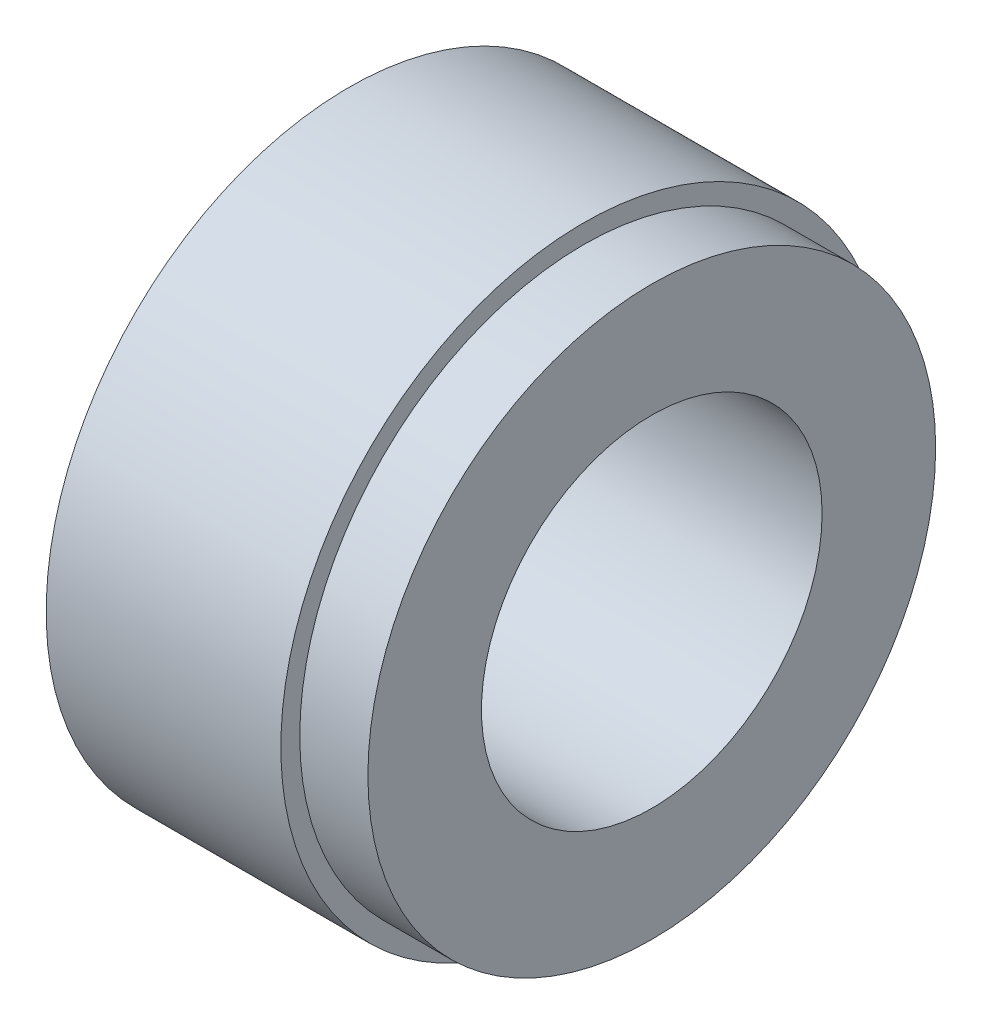
ISO-10303-21;
HEADER;
FILE_DESCRIPTION(('STEP AP214'),'2;1');
FILE_NAME('part.step','',(''),(''),'','','');
FILE_SCHEMA(('AUTOMOTIVE_DESIGN { 1 0 10303 214 1 1 1 1 }'));
ENDSEC;
DATA;
#1=APPLICATION_CONTEXT('core data for automotive mechanical design processes');
#2=APPLICATION_PROTOCOL_DEFINITION('international standard','automotive_design',2000,#1);
#3=PRODUCT_CONTEXT('',#1,'mechanical');
#4=PRODUCT('Part','Part','',(#3));
#5=PRODUCT_RELATED_PRODUCT_CATEGORY('part','',(#4));
#6=PRODUCT_DEFINITION_FORMATION('','',#4);
#7=PRODUCT_DEFINITION_CONTEXT('part definition',#1,'design');
#8=PRODUCT_DEFINITION('design','',#6,#7);
#9=PRODUCT_DEFINITION_SHAPE('','',#8);
#10=(LENGTH_UNIT() NAMED_UNIT(*) SI_UNIT(.MILLI.,.METRE.));
#11=(NAMED_UNIT(*) PLANE_ANGLE_UNIT() SI_UNIT($,.RADIAN.));
#12=(NAMED_UNIT(*) SI_UNIT($,.STERADIAN.) SOLID_ANGLE_UNIT());
#13=UNCERTAINTY_MEASURE_WITH_UNIT(LENGTH_MEASURE(1.E-05),#10,'distance_accuracy_value','');
#14=(GEOMETRIC_REPRESENTATION_CONTEXT(3) GLOBAL_UNCERTAINTY_ASSIGNED_CONTEXT((#13)) GLOBAL_UNIT_ASSIGNED_CONTEXT((#10,
#11,#12)) REPRESENTATION_CONTEXT('',''));
#15=CARTESIAN_POINT('',(0.,0.,0.));
#16=DIRECTION('',(0.,0.,1.));
#17=DIRECTION('',(1.,0.,0.));
#18=AXIS2_PLACEMENT_3D('',#15,#16,#17);
#19=CARTESIAN_POINT('',(0.,0.,0.));
#20=DIRECTION('',(1.,0.,0.));
#21=DIRECTION('',(0.,0.,-1.));
#22=AXIS2_PLACEMENT_3D('',#19,#20,#21);
#23=CYLINDRICAL_SURFACE('',#22,4.5);
#24=CARTESIAN_POINT('',(0.,0.,0.));
#25=DIRECTION('',(1.,0.,0.));
#26=DIRECTION('',(0.,0.,-1.));
#27=AXIS2_PLACEMENT_3D('',#24,#25,#26);
#28=CIRCLE('',#27,4.5);
#29=CARTESIAN_POINT('',(0.,0.,-4.5));
#30=VERTEX_POINT('',#29);
#31=EDGE_CURVE('E10',#30,#30,#28,.T.);
#32=ORIENTED_EDGE('',*,*,#31,.T.);
#33=EDGE_LOOP('',(#32));
#34=FACE_BOUND('',#33,.T.);
#35=CARTESIAN_POINT('',(-8.,0.,0.));
#36=DIRECTION('',(1.,0.,0.));
#37=DIRECTION('',(0.,0.,-1.));
#38=AXIS2_PLACEMENT_3D('',#35,#36,#37);
#39=CIRCLE('',#38,4.5);
#40=CARTESIAN_POINT('',(-8.,0.,-4.5));
#41=VERTEX_POINT('',#40);
#42=EDGE_CURVE('E46',#41,#41,#39,.T.);
#43=ORIENTED_EDGE('',*,*,#42,.F.);
#44=EDGE_LOOP('',(#43));
#45=FACE_BOUND('',#44,.T.);
#46=ADVANCED_FACE('F24',(#34,#45),#23,.F.);
#47=CARTESIAN_POINT('',(0.,4.5,0.));
#48=DIRECTION('',(1.,0.,0.));
#49=DIRECTION('',(0.,0.,-1.));
#50=AXIS2_PLACEMENT_3D('',#47,#48,#49);
#51=PLANE('',#50);
#52=CARTESIAN_POINT('',(0.,0.,0.));
#53=DIRECTION('',(1.,0.,0.));
#54=DIRECTION('',(0.,0.,-1.));
#55=AXIS2_PLACEMENT_3D('',#52,#53,#54);
#56=CIRCLE('',#55,7.5);
#57=CARTESIAN_POINT('',(0.,0.,-7.5));
#58=VERTEX_POINT('',#57);
#59=EDGE_CURVE('E30',#58,#58,#56,.T.);
#60=ORIENTED_EDGE('',*,*,#59,.T.);
#61=EDGE_LOOP('',(#60));
#62=FACE_BOUND('',#61,.T.);
#63=ORIENTED_EDGE('',*,*,#31,.F.);
#64=EDGE_LOOP('',(#63));
#65=FACE_BOUND('',#64,.T.);
#66=ADVANCED_FACE('F54',(#62,#65),#51,.T.);
#67=CARTESIAN_POINT('',(0.,0.,0.));
#68=DIRECTION('',(1.,0.,0.));
#69=DIRECTION('',(0.,0.,-1.));
#70=AXIS2_PLACEMENT_3D('',#67,#68,#69);
#71=CYLINDRICAL_SURFACE('',#70,7.5);
#72=CARTESIAN_POINT('',(-1.8,0.,0.));
#73=DIRECTION('',(1.,0.,0.));
#74=DIRECTION('',(0.,0.,-1.));
#75=AXIS2_PLACEMENT_3D('',#72,#73,#74);
#76=CIRCLE('',#75,7.5);
#77=CARTESIAN_POINT('',(-1.8,0.,-7.5));
#78=VERTEX_POINT('',#77);
#79=EDGE_CURVE('E34',#78,#78,#76,.T.);
#80=ORIENTED_EDGE('',*,*,#79,.T.);
#81=EDGE_LOOP('',(#80));
#82=FACE_BOUND('',#81,.T.);
#83=ORIENTED_EDGE('',*,*,#59,.F.);
#84=EDGE_LOOP('',(#83));
#85=FACE_BOUND('',#84,.T.);
#86=ADVANCED_FACE('F58',(#82,#85),#71,.T.);
#87=CARTESIAN_POINT('',(-1.8,7.5,0.));
#88=DIRECTION('',(1.,0.,0.));
#89=DIRECTION('',(0.,0.,-1.));
#90=AXIS2_PLACEMENT_3D('',#87,#88,#89);
#91=PLANE('',#90);
#92=CARTESIAN_POINT('',(-1.8,0.,0.));
#93=DIRECTION('',(1.,0.,0.));
#94=DIRECTION('',(0.,0.,-1.));
#95=AXIS2_PLACEMENT_3D('',#92,#93,#94);
#96=CIRCLE('',#95,8.);
#97=CARTESIAN_POINT('',(-1.8,0.,-8.));
#98=VERTEX_POINT('',#97);
#99=EDGE_CURVE('E38',#98,#98,#96,.T.);
#100=ORIENTED_EDGE('',*,*,#99,.T.);
#101=EDGE_LOOP('',(#100));
#102=FACE_BOUND('',#101,.T.);
#103=ORIENTED_EDGE('',*,*,#79,.F.);
#104=EDGE_LOOP('',(#103));
#105=FACE_BOUND('',#104,.T.);
#106=ADVANCED_FACE('F62',(#102,#105),#91,.T.);
#107=CARTESIAN_POINT('',(0.,0.,0.));
#108=DIRECTION('',(1.,0.,0.));
#109=DIRECTION('',(0.,0.,-1.));
#110=AXIS2_PLACEMENT_3D('',#107,#108,#109);
#111=CYLINDRICAL_SURFACE('',#110,8.);
#112=CARTESIAN_POINT('',(-8.,0.,0.));
#113=DIRECTION('',(1.,0.,0.));
#114=DIRECTION('',(0.,0.,-1.));
#115=AXIS2_PLACEMENT_3D('',#112,#113,#114);
#116=CIRCLE('',#115,8.);
#117=CARTESIAN_POINT('',(-8.,0.,-8.));
#118=VERTEX_POINT('',#117);
#119=EDGE_CURVE('E43',#118,#118,#116,.T.);
#120=ORIENTED_EDGE('',*,*,#119,.T.);
#121=EDGE_LOOP('',(#120));
#122=FACE_BOUND('',#121,.T.);
#123=ORIENTED_EDGE('',*,*,#99,.F.);
#124=EDGE_LOOP('',(#123));
#125=FACE_BOUND('',#124,.T.);
#126=ADVANCED_FACE('F69',(#122,#125),#111,.T.);
#127=CARTESIAN_POINT('',(-8.,8.,0.));
#128=DIRECTION('',(-1.,0.,0.));
#129=DIRECTION('',(0.,0.,1.));
#130=AXIS2_PLACEMENT_3D('',#127,#128,#129);
#131=PLANE('',#130);
#132=ORIENTED_EDGE('',*,*,#42,.T.);
#133=EDGE_LOOP('',(#132));
#134=FACE_BOUND('',#133,.T.);
#135=ORIENTED_EDGE('',*,*,#119,.F.);
#136=EDGE_LOOP('',(#135));
#137=FACE_BOUND('',#136,.T.);
#138=ADVANCED_FACE('F50',(#134,#137),#131,.T.);
#139=CLOSED_SHELL('',(#46,#66,#86,#106,#126,#138));
#140=MANIFOLD_SOLID_BREP('B2',#139);
#141=ADVANCED_BREP_SHAPE_REPRESENTATION('',(#18,#140),#14);
#142=SHAPE_DEFINITION_REPRESENTATION(#9,#141);
ENDSEC;
END-ISO-10303-21;
